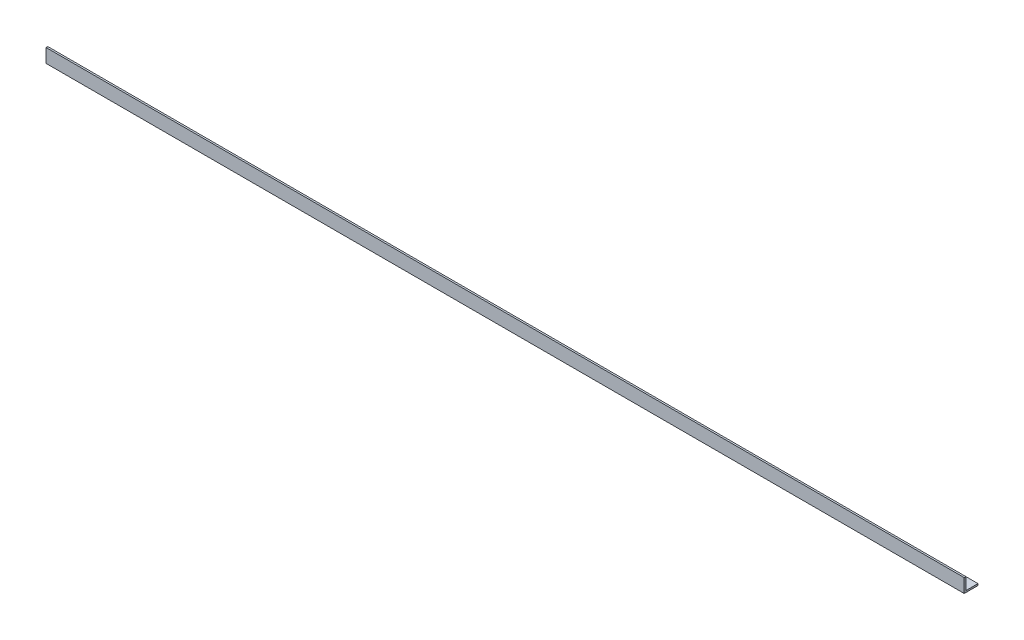
ISO-10303-21;
HEADER;
FILE_DESCRIPTION(('STEP AP214'),'2;1');
FILE_NAME('part.step','',(''),(''),'','','');
FILE_SCHEMA(('AUTOMOTIVE_DESIGN { 1 0 10303 214 1 1 1 1 }'));
ENDSEC;
DATA;
#1=APPLICATION_CONTEXT('core data for automotive mechanical design processes');
#2=APPLICATION_PROTOCOL_DEFINITION('international standard','automotive_design',2000,#1);
#3=PRODUCT_CONTEXT('',#1,'mechanical');
#4=PRODUCT('Part','Part','',(#3));
#5=PRODUCT_RELATED_PRODUCT_CATEGORY('part','',(#4));
#6=PRODUCT_DEFINITION_FORMATION('','',#4);
#7=PRODUCT_DEFINITION_CONTEXT('part definition',#1,'design');
#8=PRODUCT_DEFINITION('design','',#6,#7);
#9=PRODUCT_DEFINITION_SHAPE('','',#8);
#10=(LENGTH_UNIT() NAMED_UNIT(*) SI_UNIT(.MILLI.,.METRE.));
#11=(NAMED_UNIT(*) PLANE_ANGLE_UNIT() SI_UNIT($,.RADIAN.));
#12=(NAMED_UNIT(*) SI_UNIT($,.STERADIAN.) SOLID_ANGLE_UNIT());
#13=UNCERTAINTY_MEASURE_WITH_UNIT(LENGTH_MEASURE(1.E-05),#10,'distance_accuracy_value','');
#14=(GEOMETRIC_REPRESENTATION_CONTEXT(3) GLOBAL_UNCERTAINTY_ASSIGNED_CONTEXT((#13)) GLOBAL_UNIT_ASSIGNED_CONTEXT((#10,
#11,#12)) REPRESENTATION_CONTEXT('',''));
#15=CARTESIAN_POINT('',(0.,0.,0.));
#16=DIRECTION('',(0.,0.,1.));
#17=DIRECTION('',(1.,0.,0.));
#18=AXIS2_PLACEMENT_3D('',#15,#16,#17);
#19=CARTESIAN_POINT('',(2665.,0.,0.));
#20=DIRECTION('',(0.,1.,0.));
#21=DIRECTION('',(0.,0.,1.));
#22=AXIS2_PLACEMENT_3D('',#19,#20,#21);
#23=PLANE('',#22);
#24=DIRECTION('',(0.,0.,-1.));
#25=VECTOR('',#24,1.);
#26=CARTESIAN_POINT('',(0.,0.,0.));
#27=LINE('',#26,#25);
#28=CARTESIAN_POINT('',(0.,0.,0.));
#29=VERTEX_POINT('',#28);
#30=CARTESIAN_POINT('',(0.,0.,-40.));
#31=VERTEX_POINT('',#30);
#32=EDGE_CURVE('E119',#29,#31,#27,.T.);
#33=ORIENTED_EDGE('',*,*,#32,.T.);
#34=DIRECTION('',(-1.,0.,0.));
#35=VECTOR('',#34,1.);
#36=CARTESIAN_POINT('',(2665.,0.,-40.));
#37=LINE('',#36,#35);
#38=CARTESIAN_POINT('',(2665.,0.,-40.));
#39=VERTEX_POINT('',#38);
#40=EDGE_CURVE('E11',#39,#31,#37,.T.);
#41=ORIENTED_EDGE('',*,*,#40,.F.);
#42=DIRECTION('',(0.,0.,-1.));
#43=VECTOR('',#42,1.);
#44=CARTESIAN_POINT('',(2665.,0.,0.));
#45=LINE('',#44,#43);
#46=CARTESIAN_POINT('',(2665.,0.,0.));
#47=VERTEX_POINT('',#46);
#48=EDGE_CURVE('E83',#47,#39,#45,.T.);
#49=ORIENTED_EDGE('',*,*,#48,.F.);
#50=DIRECTION('',(-1.,0.,0.));
#51=VECTOR('',#50,1.);
#52=CARTESIAN_POINT('',(2665.,0.,0.));
#53=LINE('',#52,#51);
#54=EDGE_CURVE('E115',#47,#29,#53,.T.);
#55=ORIENTED_EDGE('',*,*,#54,.T.);
#56=EDGE_LOOP('',(#33,#41,#49,#55));
#57=FACE_BOUND('',#56,.T.);
#58=ADVANCED_FACE('F36',(#57),#23,.F.);
#59=CARTESIAN_POINT('',(2665.,5.,-40.));
#60=DIRECTION('',(0.,0.,-1.));
#61=DIRECTION('',(-1.,0.,0.));
#62=AXIS2_PLACEMENT_3D('',#59,#60,#61);
#63=PLANE('',#62);
#64=DIRECTION('',(0.,-1.,0.));
#65=VECTOR('',#64,1.);
#66=CARTESIAN_POINT('',(0.,5.,-40.));
#67=LINE('',#66,#65);
#68=CARTESIAN_POINT('',(0.,5.,-40.));
#69=VERTEX_POINT('',#68);
#70=EDGE_CURVE('E122',#69,#31,#67,.T.);
#71=ORIENTED_EDGE('',*,*,#70,.F.);
#72=DIRECTION('',(-1.,0.,0.));
#73=VECTOR('',#72,1.);
#74=CARTESIAN_POINT('',(2665.,5.,-40.));
#75=LINE('',#74,#73);
#76=CARTESIAN_POINT('',(2665.,5.,-40.));
#77=VERTEX_POINT('',#76);
#78=EDGE_CURVE('E45',#77,#69,#75,.T.);
#79=ORIENTED_EDGE('',*,*,#78,.F.);
#80=DIRECTION('',(0.,-1.,0.));
#81=VECTOR('',#80,1.);
#82=CARTESIAN_POINT('',(2665.,5.,-40.));
#83=LINE('',#82,#81);
#84=EDGE_CURVE('E212',#77,#39,#83,.T.);
#85=ORIENTED_EDGE('',*,*,#84,.T.);
#86=ORIENTED_EDGE('',*,*,#40,.T.);
#87=EDGE_LOOP('',(#71,#79,#85,#86));
#88=FACE_BOUND('',#87,.T.);
#89=ADVANCED_FACE('F144',(#88),#63,.T.);
#90=CARTESIAN_POINT('',(2665.,5.,0.));
#91=DIRECTION('',(0.,1.,0.));
#92=DIRECTION('',(0.,0.,1.));
#93=AXIS2_PLACEMENT_3D('',#90,#91,#92);
#94=PLANE('',#93);
#95=DIRECTION('',(0.,0.,-1.));
#96=VECTOR('',#95,1.);
#97=CARTESIAN_POINT('',(0.,5.,0.));
#98=LINE('',#97,#96);
#99=CARTESIAN_POINT('',(0.,5.,-5.));
#100=VERTEX_POINT('',#99);
#101=EDGE_CURVE('E125',#100,#69,#98,.T.);
#102=ORIENTED_EDGE('',*,*,#101,.F.);
#103=DIRECTION('',(-1.,0.,0.));
#104=VECTOR('',#103,1.);
#105=CARTESIAN_POINT('',(2665.,5.,-5.));
#106=LINE('',#105,#104);
#107=CARTESIAN_POINT('',(2665.,5.,-5.));
#108=VERTEX_POINT('',#107);
#109=EDGE_CURVE('E105',#108,#100,#106,.T.);
#110=ORIENTED_EDGE('',*,*,#109,.F.);
#111=DIRECTION('',(0.,0.,-1.));
#112=VECTOR('',#111,1.);
#113=CARTESIAN_POINT('',(2665.,5.,0.));
#114=LINE('',#113,#112);
#115=EDGE_CURVE('E111',#108,#77,#114,.T.);
#116=ORIENTED_EDGE('',*,*,#115,.T.);
#117=ORIENTED_EDGE('',*,*,#78,.T.);
#118=EDGE_LOOP('',(#102,#110,#116,#117));
#119=FACE_BOUND('',#118,.T.);
#120=ADVANCED_FACE('F141',(#119),#94,.T.);
#121=CARTESIAN_POINT('',(2665.,40.,-5.));
#122=DIRECTION('',(0.,0.,-1.));
#123=DIRECTION('',(0.,1.,0.));
#124=AXIS2_PLACEMENT_3D('',#121,#122,#123);
#125=PLANE('',#124);
#126=DIRECTION('',(0.,-1.,0.));
#127=VECTOR('',#126,1.);
#128=CARTESIAN_POINT('',(0.,40.,-5.));
#129=LINE('',#128,#127);
#130=CARTESIAN_POINT('',(0.,40.,-5.));
#131=VERTEX_POINT('',#130);
#132=EDGE_CURVE('E99',#131,#100,#129,.T.);
#133=ORIENTED_EDGE('',*,*,#132,.F.);
#134=DIRECTION('',(-1.,0.,0.));
#135=VECTOR('',#134,1.);
#136=CARTESIAN_POINT('',(2665.,40.,-5.));
#137=LINE('',#136,#135);
#138=CARTESIAN_POINT('',(2665.,40.,-5.));
#139=VERTEX_POINT('',#138);
#140=EDGE_CURVE('E94',#139,#131,#137,.T.);
#141=ORIENTED_EDGE('',*,*,#140,.F.);
#142=DIRECTION('',(0.,-1.,0.));
#143=VECTOR('',#142,1.);
#144=CARTESIAN_POINT('',(2665.,40.,-5.));
#145=LINE('',#144,#143);
#146=EDGE_CURVE('E97',#139,#108,#145,.T.);
#147=ORIENTED_EDGE('',*,*,#146,.T.);
#148=ORIENTED_EDGE('',*,*,#109,.T.);
#149=EDGE_LOOP('',(#133,#141,#147,#148));
#150=FACE_BOUND('',#149,.T.);
#151=ADVANCED_FACE('F96',(#150),#125,.T.);
#152=CARTESIAN_POINT('',(2665.,40.,0.));
#153=DIRECTION('',(0.,1.,0.));
#154=DIRECTION('',(0.,0.,1.));
#155=AXIS2_PLACEMENT_3D('',#152,#153,#154);
#156=PLANE('',#155);
#157=DIRECTION('',(0.,0.,-1.));
#158=VECTOR('',#157,1.);
#159=CARTESIAN_POINT('',(0.,40.,0.));
#160=LINE('',#159,#158);
#161=CARTESIAN_POINT('',(0.,40.,0.));
#162=VERTEX_POINT('',#161);
#163=EDGE_CURVE('E129',#162,#131,#160,.T.);
#164=ORIENTED_EDGE('',*,*,#163,.F.);
#165=DIRECTION('',(-1.,0.,0.));
#166=VECTOR('',#165,1.);
#167=CARTESIAN_POINT('',(2665.,40.,0.));
#168=LINE('',#167,#166);
#169=CARTESIAN_POINT('',(2665.,40.,0.));
#170=VERTEX_POINT('',#169);
#171=EDGE_CURVE('E74',#170,#162,#168,.T.);
#172=ORIENTED_EDGE('',*,*,#171,.F.);
#173=DIRECTION('',(0.,0.,-1.));
#174=VECTOR('',#173,1.);
#175=CARTESIAN_POINT('',(2665.,40.,0.));
#176=LINE('',#175,#174);
#177=EDGE_CURVE('E109',#170,#139,#176,.T.);
#178=ORIENTED_EDGE('',*,*,#177,.T.);
#179=ORIENTED_EDGE('',*,*,#140,.T.);
#180=EDGE_LOOP('',(#164,#172,#178,#179));
#181=FACE_BOUND('',#180,.T.);
#182=ADVANCED_FACE('F113',(#181),#156,.T.);
#183=CARTESIAN_POINT('',(2665.,40.,0.));
#184=DIRECTION('',(0.,0.,-1.));
#185=DIRECTION('',(0.,1.,0.));
#186=AXIS2_PLACEMENT_3D('',#183,#184,#185);
#187=PLANE('',#186);
#188=DIRECTION('',(0.,-1.,0.));
#189=VECTOR('',#188,1.);
#190=CARTESIAN_POINT('',(0.,40.,0.));
#191=LINE('',#190,#189);
#192=EDGE_CURVE('E77',#162,#29,#191,.T.);
#193=ORIENTED_EDGE('',*,*,#192,.T.);
#194=ORIENTED_EDGE('',*,*,#54,.F.);
#195=DIRECTION('',(0.,-1.,0.));
#196=VECTOR('',#195,1.);
#197=CARTESIAN_POINT('',(2665.,40.,0.));
#198=LINE('',#197,#196);
#199=EDGE_CURVE('E53',#170,#47,#198,.T.);
#200=ORIENTED_EDGE('',*,*,#199,.F.);
#201=ORIENTED_EDGE('',*,*,#171,.T.);
#202=EDGE_LOOP('',(#193,#194,#200,#201));
#203=FACE_BOUND('',#202,.T.);
#204=ADVANCED_FACE('F149',(#203),#187,.F.);
#205=CARTESIAN_POINT('',(2665.,0.,0.));
#206=DIRECTION('',(-1.,0.,0.));
#207=DIRECTION('',(0.,0.,1.));
#208=AXIS2_PLACEMENT_3D('',#205,#206,#207);
#209=PLANE('',#208);
#210=ORIENTED_EDGE('',*,*,#48,.T.);
#211=ORIENTED_EDGE('',*,*,#84,.F.);
#212=ORIENTED_EDGE('',*,*,#115,.F.);
#213=ORIENTED_EDGE('',*,*,#146,.F.);
#214=ORIENTED_EDGE('',*,*,#177,.F.);
#215=ORIENTED_EDGE('',*,*,#199,.T.);
#216=EDGE_LOOP('',(#210,#211,#212,#213,#214,#215));
#217=FACE_BOUND('',#216,.T.);
#218=ADVANCED_FACE('F108',(#217),#209,.F.);
#219=CARTESIAN_POINT('',(0.,0.,0.));
#220=DIRECTION('',(-1.,0.,0.));
#221=DIRECTION('',(0.,0.,1.));
#222=AXIS2_PLACEMENT_3D('',#219,#220,#221);
#223=PLANE('',#222);
#224=ORIENTED_EDGE('',*,*,#32,.F.);
#225=ORIENTED_EDGE('',*,*,#192,.F.);
#226=ORIENTED_EDGE('',*,*,#163,.T.);
#227=ORIENTED_EDGE('',*,*,#132,.T.);
#228=ORIENTED_EDGE('',*,*,#101,.T.);
#229=ORIENTED_EDGE('',*,*,#70,.T.);
#230=EDGE_LOOP('',(#224,#225,#226,#227,#228,#229));
#231=FACE_BOUND('',#230,.T.);
#232=ADVANCED_FACE('F147',(#231),#223,.T.);
#233=CLOSED_SHELL('',(#58,#89,#120,#151,#182,#204,#218,#232));
#234=MANIFOLD_SOLID_BREP('B2',#233);
#235=ADVANCED_BREP_SHAPE_REPRESENTATION('',(#18,#234),#14);
#236=SHAPE_DEFINITION_REPRESENTATION(#9,#235);
ENDSEC;
END-ISO-10303-21;
